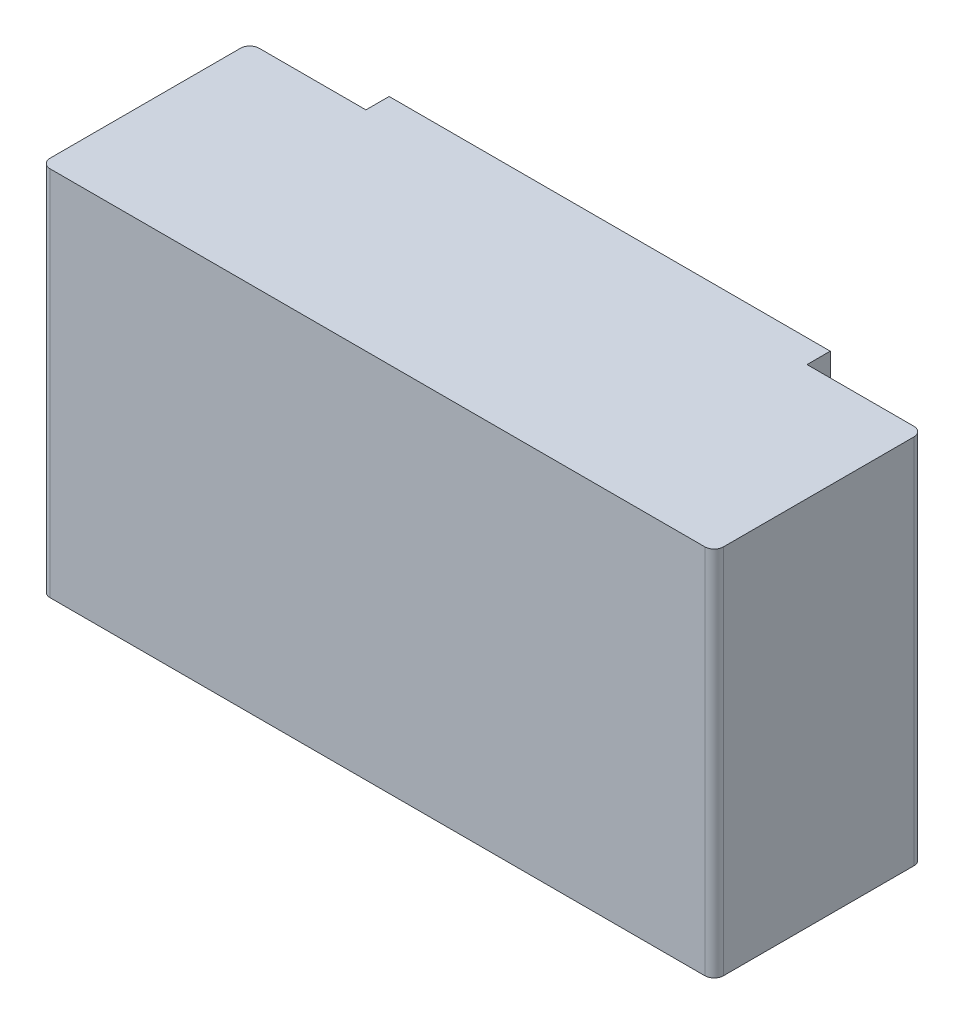
ISO-10303-21;
HEADER;
FILE_DESCRIPTION(('STEP AP214'),'2;1');
FILE_NAME('part.step','',(''),(''),'','','');
FILE_SCHEMA(('AUTOMOTIVE_DESIGN { 1 0 10303 214 1 1 1 1 }'));
ENDSEC;
DATA;
#1=APPLICATION_CONTEXT('core data for automotive mechanical design processes');
#2=APPLICATION_PROTOCOL_DEFINITION('international standard','automotive_design',2000,#1);
#3=PRODUCT_CONTEXT('',#1,'mechanical');
#4=PRODUCT('Part','Part','',(#3));
#5=PRODUCT_RELATED_PRODUCT_CATEGORY('part','',(#4));
#6=PRODUCT_DEFINITION_FORMATION('','',#4);
#7=PRODUCT_DEFINITION_CONTEXT('part definition',#1,'design');
#8=PRODUCT_DEFINITION('design','',#6,#7);
#9=PRODUCT_DEFINITION_SHAPE('','',#8);
#10=(LENGTH_UNIT() NAMED_UNIT(*) SI_UNIT(.MILLI.,.METRE.));
#11=(NAMED_UNIT(*) PLANE_ANGLE_UNIT() SI_UNIT($,.RADIAN.));
#12=(NAMED_UNIT(*) SI_UNIT($,.STERADIAN.) SOLID_ANGLE_UNIT());
#13=UNCERTAINTY_MEASURE_WITH_UNIT(LENGTH_MEASURE(1.E-05),#10,'distance_accuracy_value','');
#14=(GEOMETRIC_REPRESENTATION_CONTEXT(3) GLOBAL_UNCERTAINTY_ASSIGNED_CONTEXT((#13)) GLOBAL_UNIT_ASSIGNED_CONTEXT((#10,
#11,#12)) REPRESENTATION_CONTEXT('',''));
#15=CARTESIAN_POINT('',(0.,0.,0.));
#16=DIRECTION('',(0.,0.,1.));
#17=DIRECTION('',(1.,0.,0.));
#18=AXIS2_PLACEMENT_3D('',#15,#16,#17);
#19=CARTESIAN_POINT('',(0.725,0.4,0.5));
#20=DIRECTION('',(1.,0.,0.));
#21=DIRECTION('',(0.,0.,-1.));
#22=AXIS2_PLACEMENT_3D('',#19,#20,#21);
#23=PLANE('',#22);
#24=DIRECTION('',(0.,1.,0.));
#25=VECTOR('',#24,1.);
#26=CARTESIAN_POINT('',(0.725,0.4,0.48));
#27=LINE('',#26,#25);
#28=CARTESIAN_POINT('',(0.725,-0.4,0.48));
#29=VERTEX_POINT('',#28);
#30=CARTESIAN_POINT('',(0.725,0.4,0.48));
#31=VERTEX_POINT('',#30);
#32=EDGE_CURVE('E163',#29,#31,#27,.T.);
#33=ORIENTED_EDGE('',*,*,#32,.F.);
#34=DIRECTION('',(0.,0.,-1.));
#35=VECTOR('',#34,1.);
#36=CARTESIAN_POINT('',(0.725,-0.4,0.));
#37=LINE('',#36,#35);
#38=CARTESIAN_POINT('',(0.725,-0.4,0.07));
#39=VERTEX_POINT('',#38);
#40=EDGE_CURVE('E101',#39,#29,#37,.F.);
#41=ORIENTED_EDGE('',*,*,#40,.F.);
#42=DIRECTION('',(0.,-1.,0.));
#43=VECTOR('',#42,1.);
#44=CARTESIAN_POINT('',(0.725,0.4,0.07));
#45=LINE('',#44,#43);
#46=CARTESIAN_POINT('',(0.725,0.4,0.07));
#47=VERTEX_POINT('',#46);
#48=EDGE_CURVE('E161',#47,#39,#45,.T.);
#49=ORIENTED_EDGE('',*,*,#48,.F.);
#50=DIRECTION('',(0.,0.,1.));
#51=VECTOR('',#50,1.);
#52=CARTESIAN_POINT('',(0.725,0.4,0.));
#53=LINE('',#52,#51);
#54=EDGE_CURVE('E185',#31,#47,#53,.F.);
#55=ORIENTED_EDGE('',*,*,#54,.F.);
#56=EDGE_LOOP('',(#33,#41,#49,#55));
#57=FACE_BOUND('',#56,.T.);
#58=ADVANCED_FACE('F17',(#57),#23,.T.);
#59=CARTESIAN_POINT('',(0.705,0.4,0.07));
#60=DIRECTION('',(0.,-1.,0.));
#61=DIRECTION('',(0.,0.,-1.));
#62=AXIS2_PLACEMENT_3D('',#59,#60,#61);
#63=CYLINDRICAL_SURFACE('',#62,0.02);
#64=CARTESIAN_POINT('',(0.705,0.4,0.07));
#65=DIRECTION('',(0.,-1.,0.));
#66=DIRECTION('',(0.,0.,-1.));
#67=AXIS2_PLACEMENT_3D('',#64,#65,#66);
#68=CIRCLE('',#67,0.02);
#69=CARTESIAN_POINT('',(0.705,0.4,0.05));
#70=VERTEX_POINT('',#69);
#71=EDGE_CURVE('E182',#47,#70,#68,.F.);
#72=ORIENTED_EDGE('',*,*,#71,.F.);
#73=ORIENTED_EDGE('',*,*,#48,.T.);
#74=CARTESIAN_POINT('',(0.705,-0.4,0.07));
#75=DIRECTION('',(0.,-1.,0.));
#76=DIRECTION('',(0.,0.,-1.));
#77=AXIS2_PLACEMENT_3D('',#74,#75,#76);
#78=CIRCLE('',#77,0.02);
#79=CARTESIAN_POINT('',(0.705,-0.4,0.05));
#80=VERTEX_POINT('',#79);
#81=EDGE_CURVE('E103',#80,#39,#78,.T.);
#82=ORIENTED_EDGE('',*,*,#81,.F.);
#83=DIRECTION('',(0.,1.,0.));
#84=VECTOR('',#83,1.);
#85=CARTESIAN_POINT('',(0.705,0.4,0.05));
#86=LINE('',#85,#84);
#87=EDGE_CURVE('E157',#70,#80,#86,.F.);
#88=ORIENTED_EDGE('',*,*,#87,.F.);
#89=EDGE_LOOP('',(#72,#73,#82,#88));
#90=FACE_BOUND('',#89,.T.);
#91=ADVANCED_FACE('F238',(#90),#63,.T.);
#92=CARTESIAN_POINT('',(0.725,0.4,0.05));
#93=DIRECTION('',(0.,0.,-1.));
#94=DIRECTION('',(-1.,0.,0.));
#95=AXIS2_PLACEMENT_3D('',#92,#93,#94);
#96=PLANE('',#95);
#97=DIRECTION('',(0.,1.,0.));
#98=VECTOR('',#97,1.);
#99=CARTESIAN_POINT('',(0.475,0.4,0.05));
#100=LINE('',#99,#98);
#101=CARTESIAN_POINT('',(0.475,0.4,0.05));
#102=VERTEX_POINT('',#101);
#103=CARTESIAN_POINT('',(0.475,-0.4,0.05));
#104=VERTEX_POINT('',#103);
#105=EDGE_CURVE('E147',#102,#104,#100,.F.);
#106=ORIENTED_EDGE('',*,*,#105,.F.);
#107=DIRECTION('',(1.,0.,0.));
#108=VECTOR('',#107,1.);
#109=CARTESIAN_POINT('',(0.775,0.4,0.05));
#110=LINE('',#109,#108);
#111=EDGE_CURVE('E152',#70,#102,#110,.F.);
#112=ORIENTED_EDGE('',*,*,#111,.F.);
#113=ORIENTED_EDGE('',*,*,#87,.T.);
#114=DIRECTION('',(1.,0.,0.));
#115=VECTOR('',#114,1.);
#116=CARTESIAN_POINT('',(-0.775,-0.4,0.05));
#117=LINE('',#116,#115);
#118=EDGE_CURVE('E104',#104,#80,#117,.T.);
#119=ORIENTED_EDGE('',*,*,#118,.F.);
#120=EDGE_LOOP('',(#106,#112,#113,#119));
#121=FACE_BOUND('',#120,.T.);
#122=ADVANCED_FACE('F243',(#121),#96,.T.);
#123=CARTESIAN_POINT('',(0.475,0.4,0.137097424126));
#124=DIRECTION('',(1.,0.,0.));
#125=DIRECTION('',(0.,0.,-1.));
#126=AXIS2_PLACEMENT_3D('',#123,#124,#125);
#127=PLANE('',#126);
#128=DIRECTION('',(0.,0.,1.));
#129=VECTOR('',#128,1.);
#130=CARTESIAN_POINT('',(0.475,0.4,0.));
#131=LINE('',#130,#129);
#132=CARTESIAN_POINT('',(0.475,0.4,0.));
#133=VERTEX_POINT('',#132);
#134=EDGE_CURVE('E142',#102,#133,#131,.F.);
#135=ORIENTED_EDGE('',*,*,#134,.F.);
#136=ORIENTED_EDGE('',*,*,#105,.T.);
#137=DIRECTION('',(0.,0.,-1.));
#138=VECTOR('',#137,1.);
#139=CARTESIAN_POINT('',(0.475,-0.4,0.));
#140=LINE('',#139,#138);
#141=CARTESIAN_POINT('',(0.475,-0.4,0.));
#142=VERTEX_POINT('',#141);
#143=EDGE_CURVE('E107',#142,#104,#140,.F.);
#144=ORIENTED_EDGE('',*,*,#143,.F.);
#145=DIRECTION('',(0.,1.,0.));
#146=VECTOR('',#145,1.);
#147=CARTESIAN_POINT('',(0.475,0.,0.));
#148=LINE('',#147,#146);
#149=EDGE_CURVE('E137',#142,#133,#148,.T.);
#150=ORIENTED_EDGE('',*,*,#149,.T.);
#151=EDGE_LOOP('',(#135,#136,#144,#150));
#152=FACE_BOUND('',#151,.T.);
#153=ADVANCED_FACE('F255',(#152),#127,.T.);
#154=CARTESIAN_POINT('',(0.,0.,0.));
#155=DIRECTION('',(0.,0.,1.));
#156=DIRECTION('',(1.,0.,0.));
#157=AXIS2_PLACEMENT_3D('',#154,#155,#156);
#158=PLANE('',#157);
#159=DIRECTION('',(1.,0.,0.));
#160=VECTOR('',#159,1.);
#161=CARTESIAN_POINT('',(-0.775,-0.4,0.));
#162=LINE('',#161,#160);
#163=CARTESIAN_POINT('',(-0.475,-0.4,0.));
#164=VERTEX_POINT('',#163);
#165=EDGE_CURVE('E169',#164,#142,#162,.T.);
#166=ORIENTED_EDGE('',*,*,#165,.F.);
#167=DIRECTION('',(0.,1.,0.));
#168=VECTOR('',#167,1.);
#169=CARTESIAN_POINT('',(-0.475,0.4,0.));
#170=LINE('',#169,#168);
#171=CARTESIAN_POINT('',(-0.475,0.4,0.));
#172=VERTEX_POINT('',#171);
#173=EDGE_CURVE('E125',#172,#164,#170,.F.);
#174=ORIENTED_EDGE('',*,*,#173,.F.);
#175=DIRECTION('',(1.,0.,0.));
#176=VECTOR('',#175,1.);
#177=CARTESIAN_POINT('',(0.775,0.4,0.));
#178=LINE('',#177,#176);
#179=EDGE_CURVE('E132',#133,#172,#178,.F.);
#180=ORIENTED_EDGE('',*,*,#179,.F.);
#181=ORIENTED_EDGE('',*,*,#149,.F.);
#182=EDGE_LOOP('',(#166,#174,#180,#181));
#183=FACE_BOUND('',#182,.T.);
#184=ADVANCED_FACE('F258',(#183),#158,.F.);
#185=CARTESIAN_POINT('',(-0.475,0.4,-0.03709742412571));
#186=DIRECTION('',(-1.,0.,0.));
#187=DIRECTION('',(0.,0.,1.));
#188=AXIS2_PLACEMENT_3D('',#185,#186,#187);
#189=PLANE('',#188);
#190=DIRECTION('',(0.,0.,1.));
#191=VECTOR('',#190,1.);
#192=CARTESIAN_POINT('',(-0.475,0.4,0.));
#193=LINE('',#192,#191);
#194=CARTESIAN_POINT('',(-0.475,0.4,0.05));
#195=VERTEX_POINT('',#194);
#196=EDGE_CURVE('E128',#172,#195,#193,.T.);
#197=ORIENTED_EDGE('',*,*,#196,.F.);
#198=ORIENTED_EDGE('',*,*,#173,.T.);
#199=DIRECTION('',(0.,0.,-1.));
#200=VECTOR('',#199,1.);
#201=CARTESIAN_POINT('',(-0.475,-0.4,0.));
#202=LINE('',#201,#200);
#203=CARTESIAN_POINT('',(-0.475,-0.4,0.05));
#204=VERTEX_POINT('',#203);
#205=EDGE_CURVE('E113',#204,#164,#202,.T.);
#206=ORIENTED_EDGE('',*,*,#205,.F.);
#207=DIRECTION('',(0.,1.,0.));
#208=VECTOR('',#207,1.);
#209=CARTESIAN_POINT('',(-0.475,0.4,0.05));
#210=LINE('',#209,#208);
#211=EDGE_CURVE('E122',#195,#204,#210,.F.);
#212=ORIENTED_EDGE('',*,*,#211,.F.);
#213=EDGE_LOOP('',(#197,#198,#206,#212));
#214=FACE_BOUND('',#213,.T.);
#215=ADVANCED_FACE('F211',(#214),#189,.T.);
#216=CARTESIAN_POINT('',(0.725,0.4,0.05));
#217=DIRECTION('',(0.,0.,-1.));
#218=DIRECTION('',(-1.,0.,0.));
#219=AXIS2_PLACEMENT_3D('',#216,#217,#218);
#220=PLANE('',#219);
#221=ORIENTED_EDGE('',*,*,#211,.T.);
#222=DIRECTION('',(1.,0.,0.));
#223=VECTOR('',#222,1.);
#224=CARTESIAN_POINT('',(-0.775,-0.4,0.05));
#225=LINE('',#224,#223);
#226=CARTESIAN_POINT('',(-0.705,-0.4,0.05));
#227=VERTEX_POINT('',#226);
#228=EDGE_CURVE('E110',#227,#204,#225,.T.);
#229=ORIENTED_EDGE('',*,*,#228,.F.);
#230=DIRECTION('',(0.,1.,0.));
#231=VECTOR('',#230,1.);
#232=CARTESIAN_POINT('',(-0.705,0.4,0.05));
#233=LINE('',#232,#231);
#234=CARTESIAN_POINT('',(-0.705,0.4,0.05));
#235=VERTEX_POINT('',#234);
#236=EDGE_CURVE('E120',#235,#227,#233,.F.);
#237=ORIENTED_EDGE('',*,*,#236,.F.);
#238=DIRECTION('',(1.,0.,0.));
#239=VECTOR('',#238,1.);
#240=CARTESIAN_POINT('',(0.775,0.4,0.05));
#241=LINE('',#240,#239);
#242=EDGE_CURVE('E131',#195,#235,#241,.F.);
#243=ORIENTED_EDGE('',*,*,#242,.F.);
#244=EDGE_LOOP('',(#221,#229,#237,#243));
#245=FACE_BOUND('',#244,.T.);
#246=ADVANCED_FACE('F203',(#245),#220,.T.);
#247=CARTESIAN_POINT('',(-0.705,0.4,0.07));
#248=DIRECTION('',(0.,1.,0.));
#249=DIRECTION('',(0.,0.,1.));
#250=AXIS2_PLACEMENT_3D('',#247,#248,#249);
#251=CYLINDRICAL_SURFACE('',#250,0.02);
#252=CARTESIAN_POINT('',(-0.705,-0.4,0.07));
#253=DIRECTION('',(0.,1.,0.));
#254=DIRECTION('',(0.,0.,1.));
#255=AXIS2_PLACEMENT_3D('',#252,#253,#254);
#256=CIRCLE('',#255,0.02);
#257=CARTESIAN_POINT('',(-0.725,-0.4,0.07));
#258=VERTEX_POINT('',#257);
#259=EDGE_CURVE('E114',#258,#227,#256,.F.);
#260=ORIENTED_EDGE('',*,*,#259,.F.);
#261=DIRECTION('',(0.,1.,0.));
#262=VECTOR('',#261,1.);
#263=CARTESIAN_POINT('',(-0.725,0.4,0.07));
#264=LINE('',#263,#262);
#265=CARTESIAN_POINT('',(-0.725,0.4,0.07));
#266=VERTEX_POINT('',#265);
#267=EDGE_CURVE('E118',#266,#258,#264,.F.);
#268=ORIENTED_EDGE('',*,*,#267,.F.);
#269=CARTESIAN_POINT('',(-0.705,0.4,0.07));
#270=DIRECTION('',(0.,1.,0.));
#271=DIRECTION('',(0.,0.,1.));
#272=AXIS2_PLACEMENT_3D('',#269,#270,#271);
#273=CIRCLE('',#272,0.02);
#274=EDGE_CURVE('E97',#235,#266,#273,.T.);
#275=ORIENTED_EDGE('',*,*,#274,.F.);
#276=ORIENTED_EDGE('',*,*,#236,.T.);
#277=EDGE_LOOP('',(#260,#268,#275,#276));
#278=FACE_BOUND('',#277,.T.);
#279=ADVANCED_FACE('F195',(#278),#251,.T.);
#280=CARTESIAN_POINT('',(-0.725,0.4,0.05));
#281=DIRECTION('',(-1.,0.,0.));
#282=DIRECTION('',(0.,0.,1.));
#283=AXIS2_PLACEMENT_3D('',#280,#281,#282);
#284=PLANE('',#283);
#285=ORIENTED_EDGE('',*,*,#267,.T.);
#286=DIRECTION('',(0.,0.,-1.));
#287=VECTOR('',#286,1.);
#288=CARTESIAN_POINT('',(-0.725,-0.4,0.));
#289=LINE('',#288,#287);
#290=CARTESIAN_POINT('',(-0.725,-0.4,0.48));
#291=VERTEX_POINT('',#290);
#292=EDGE_CURVE('E84',#291,#258,#289,.T.);
#293=ORIENTED_EDGE('',*,*,#292,.F.);
#294=DIRECTION('',(0.,1.,0.));
#295=VECTOR('',#294,1.);
#296=CARTESIAN_POINT('',(-0.725,0.4,0.48));
#297=LINE('',#296,#295);
#298=CARTESIAN_POINT('',(-0.725,0.4,0.48));
#299=VERTEX_POINT('',#298);
#300=EDGE_CURVE('E80',#299,#291,#297,.F.);
#301=ORIENTED_EDGE('',*,*,#300,.F.);
#302=DIRECTION('',(0.,0.,1.));
#303=VECTOR('',#302,1.);
#304=CARTESIAN_POINT('',(-0.725,0.4,0.));
#305=LINE('',#304,#303);
#306=EDGE_CURVE('E94',#266,#299,#305,.T.);
#307=ORIENTED_EDGE('',*,*,#306,.F.);
#308=EDGE_LOOP('',(#285,#293,#301,#307));
#309=FACE_BOUND('',#308,.T.);
#310=ADVANCED_FACE('F281',(#309),#284,.T.);
#311=CARTESIAN_POINT('',(-0.705,0.4,0.48));
#312=DIRECTION('',(0.,1.,0.));
#313=DIRECTION('',(0.,0.,1.));
#314=AXIS2_PLACEMENT_3D('',#311,#312,#313);
#315=CYLINDRICAL_SURFACE('',#314,0.02);
#316=CARTESIAN_POINT('',(-0.705,-0.4,0.48));
#317=DIRECTION('',(0.,1.,0.));
#318=DIRECTION('',(0.,0.,1.));
#319=AXIS2_PLACEMENT_3D('',#316,#317,#318);
#320=CIRCLE('',#319,0.02);
#321=CARTESIAN_POINT('',(-0.705,-0.4,0.5));
#322=VERTEX_POINT('',#321);
#323=EDGE_CURVE('E20',#322,#291,#320,.F.);
#324=ORIENTED_EDGE('',*,*,#323,.F.);
#325=DIRECTION('',(0.,1.,0.));
#326=VECTOR('',#325,1.);
#327=CARTESIAN_POINT('',(-0.705,0.4,0.5));
#328=LINE('',#327,#326);
#329=CARTESIAN_POINT('',(-0.705,0.4,0.5));
#330=VERTEX_POINT('',#329);
#331=EDGE_CURVE('E78',#330,#322,#328,.F.);
#332=ORIENTED_EDGE('',*,*,#331,.F.);
#333=CARTESIAN_POINT('',(-0.705,0.4,0.48));
#334=DIRECTION('',(0.,1.,0.));
#335=DIRECTION('',(0.,0.,1.));
#336=AXIS2_PLACEMENT_3D('',#333,#334,#335);
#337=CIRCLE('',#336,0.02);
#338=EDGE_CURVE('E165',#299,#330,#337,.T.);
#339=ORIENTED_EDGE('',*,*,#338,.F.);
#340=ORIENTED_EDGE('',*,*,#300,.T.);
#341=EDGE_LOOP('',(#324,#332,#339,#340));
#342=FACE_BOUND('',#341,.T.);
#343=ADVANCED_FACE('F75',(#342),#315,.T.);
#344=CARTESIAN_POINT('',(-0.775,-0.4,0.));
#345=DIRECTION('',(0.,-1.,0.));
#346=DIRECTION('',(0.,0.,-1.));
#347=AXIS2_PLACEMENT_3D('',#344,#345,#346);
#348=PLANE('',#347);
#349=CARTESIAN_POINT('',(0.705,-0.4,0.48));
#350=DIRECTION('',(0.,1.,0.));
#351=DIRECTION('',(0.,0.,1.));
#352=AXIS2_PLACEMENT_3D('',#349,#350,#351);
#353=CIRCLE('',#352,0.02);
#354=CARTESIAN_POINT('',(0.705,-0.4,0.5));
#355=VERTEX_POINT('',#354);
#356=EDGE_CURVE('E89',#355,#29,#353,.T.);
#357=ORIENTED_EDGE('',*,*,#356,.F.);
#358=DIRECTION('',(1.,0.,0.));
#359=VECTOR('',#358,1.);
#360=CARTESIAN_POINT('',(-0.725,-0.4,0.5));
#361=LINE('',#360,#359);
#362=EDGE_CURVE('E86',#322,#355,#361,.T.);
#363=ORIENTED_EDGE('',*,*,#362,.F.);
#364=ORIENTED_EDGE('',*,*,#323,.T.);
#365=ORIENTED_EDGE('',*,*,#292,.T.);
#366=ORIENTED_EDGE('',*,*,#259,.T.);
#367=ORIENTED_EDGE('',*,*,#228,.T.);
#368=ORIENTED_EDGE('',*,*,#205,.T.);
#369=ORIENTED_EDGE('',*,*,#165,.T.);
#370=ORIENTED_EDGE('',*,*,#143,.T.);
#371=ORIENTED_EDGE('',*,*,#118,.T.);
#372=ORIENTED_EDGE('',*,*,#81,.T.);
#373=ORIENTED_EDGE('',*,*,#40,.T.);
#374=EDGE_LOOP('',(#357,#363,#364,#365,#366,#367,#368,#369,#370,#371,#372,#373));
#375=FACE_BOUND('',#374,.T.);
#376=ADVANCED_FACE('F87',(#375),#348,.T.);
#377=CARTESIAN_POINT('',(0.705,0.4,0.48));
#378=DIRECTION('',(0.,1.,0.));
#379=DIRECTION('',(0.,0.,1.));
#380=AXIS2_PLACEMENT_3D('',#377,#378,#379);
#381=CYLINDRICAL_SURFACE('',#380,0.02);
#382=ORIENTED_EDGE('',*,*,#356,.T.);
#383=ORIENTED_EDGE('',*,*,#32,.T.);
#384=CARTESIAN_POINT('',(0.705,0.4,0.48));
#385=DIRECTION('',(0.,1.,0.));
#386=DIRECTION('',(0.,0.,1.));
#387=AXIS2_PLACEMENT_3D('',#384,#385,#386);
#388=CIRCLE('',#387,0.02);
#389=CARTESIAN_POINT('',(0.705,0.4,0.5));
#390=VERTEX_POINT('',#389);
#391=EDGE_CURVE('E35',#390,#31,#388,.T.);
#392=ORIENTED_EDGE('',*,*,#391,.F.);
#393=DIRECTION('',(0.,1.,0.));
#394=VECTOR('',#393,1.);
#395=CARTESIAN_POINT('',(0.705,0.4,0.5));
#396=LINE('',#395,#394);
#397=EDGE_CURVE('E26',#355,#390,#396,.T.);
#398=ORIENTED_EDGE('',*,*,#397,.F.);
#399=EDGE_LOOP('',(#382,#383,#392,#398));
#400=FACE_BOUND('',#399,.T.);
#401=ADVANCED_FACE('F252',(#400),#381,.T.);
#402=CARTESIAN_POINT('',(0.775,0.4,0.));
#403=DIRECTION('',(0.,1.,0.));
#404=DIRECTION('',(0.,0.,1.));
#405=AXIS2_PLACEMENT_3D('',#402,#403,#404);
#406=PLANE('',#405);
#407=ORIENTED_EDGE('',*,*,#274,.T.);
#408=ORIENTED_EDGE('',*,*,#306,.T.);
#409=ORIENTED_EDGE('',*,*,#338,.T.);
#410=DIRECTION('',(1.,0.,0.));
#411=VECTOR('',#410,1.);
#412=CARTESIAN_POINT('',(-0.725,0.4,0.5));
#413=LINE('',#412,#411);
#414=EDGE_CURVE('E11',#390,#330,#413,.F.);
#415=ORIENTED_EDGE('',*,*,#414,.F.);
#416=ORIENTED_EDGE('',*,*,#391,.T.);
#417=ORIENTED_EDGE('',*,*,#54,.T.);
#418=ORIENTED_EDGE('',*,*,#71,.T.);
#419=ORIENTED_EDGE('',*,*,#111,.T.);
#420=ORIENTED_EDGE('',*,*,#134,.T.);
#421=ORIENTED_EDGE('',*,*,#179,.T.);
#422=ORIENTED_EDGE('',*,*,#196,.T.);
#423=ORIENTED_EDGE('',*,*,#242,.T.);
#424=EDGE_LOOP('',(#407,#408,#409,#415,#416,#417,#418,#419,#420,#421,#422,#423));
#425=FACE_BOUND('',#424,.T.);
#426=ADVANCED_FACE('F247',(#425),#406,.T.);
#427=CARTESIAN_POINT('',(-0.725,0.4,0.5));
#428=DIRECTION('',(0.,0.,1.));
#429=DIRECTION('',(1.,0.,0.));
#430=AXIS2_PLACEMENT_3D('',#427,#428,#429);
#431=PLANE('',#430);
#432=ORIENTED_EDGE('',*,*,#397,.T.);
#433=ORIENTED_EDGE('',*,*,#414,.T.);
#434=ORIENTED_EDGE('',*,*,#331,.T.);
#435=ORIENTED_EDGE('',*,*,#362,.T.);
#436=EDGE_LOOP('',(#432,#433,#434,#435));
#437=FACE_BOUND('',#436,.T.);
#438=ADVANCED_FACE('F93',(#437),#431,.T.);
#439=CLOSED_SHELL('',(#58,#91,#122,#153,#184,#215,#246,#279,#310,#343,#376,#401,#426,#438));
#440=MANIFOLD_SOLID_BREP('B1',#439);
#441=ADVANCED_BREP_SHAPE_REPRESENTATION('',(#18,#440),#14);
#442=SHAPE_DEFINITION_REPRESENTATION(#9,#441);
ENDSEC;
END-ISO-10303-21;
